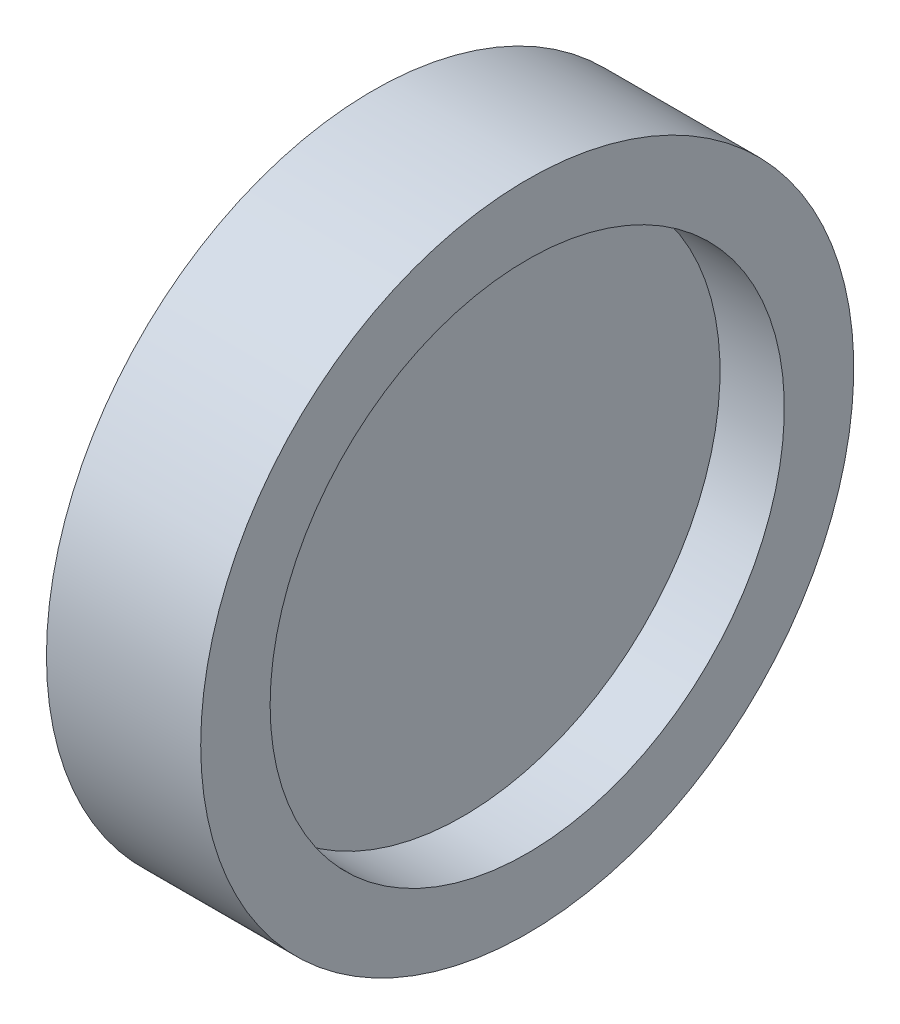
ISO-10303-21;
HEADER;
FILE_DESCRIPTION(('STEP AP214'),'2;1');
FILE_NAME('part.step','',(''),(''),'','','');
FILE_SCHEMA(('AUTOMOTIVE_DESIGN { 1 0 10303 214 1 1 1 1 }'));
ENDSEC;
DATA;
#1=APPLICATION_CONTEXT('core data for automotive mechanical design processes');
#2=APPLICATION_PROTOCOL_DEFINITION('international standard','automotive_design',2000,#1);
#3=PRODUCT_CONTEXT('',#1,'mechanical');
#4=PRODUCT('Part','Part','',(#3));
#5=PRODUCT_RELATED_PRODUCT_CATEGORY('part','',(#4));
#6=PRODUCT_DEFINITION_FORMATION('','',#4);
#7=PRODUCT_DEFINITION_CONTEXT('part definition',#1,'design');
#8=PRODUCT_DEFINITION('design','',#6,#7);
#9=PRODUCT_DEFINITION_SHAPE('','',#8);
#10=(LENGTH_UNIT() NAMED_UNIT(*) SI_UNIT(.MILLI.,.METRE.));
#11=(NAMED_UNIT(*) PLANE_ANGLE_UNIT() SI_UNIT($,.RADIAN.));
#12=(NAMED_UNIT(*) SI_UNIT($,.STERADIAN.) SOLID_ANGLE_UNIT());
#13=UNCERTAINTY_MEASURE_WITH_UNIT(LENGTH_MEASURE(1.E-05),#10,'distance_accuracy_value','');
#14=(GEOMETRIC_REPRESENTATION_CONTEXT(3) GLOBAL_UNCERTAINTY_ASSIGNED_CONTEXT((#13)) GLOBAL_UNIT_ASSIGNED_CONTEXT((#10,
#11,#12)) REPRESENTATION_CONTEXT('',''));
#15=CARTESIAN_POINT('',(0.,0.,0.));
#16=DIRECTION('',(0.,0.,1.));
#17=DIRECTION('',(1.,0.,0.));
#18=AXIS2_PLACEMENT_3D('',#15,#16,#17);
#19=CARTESIAN_POINT('',(0.500000000000001,10.,0.));
#20=DIRECTION('',(-1.,0.,0.));
#21=DIRECTION('',(0.,0.,1.));
#22=AXIS2_PLACEMENT_3D('',#19,#20,#21);
#23=PLANE('',#22);
#24=CARTESIAN_POINT('',(0.500000000000001,0.,0.));
#25=DIRECTION('',(-1.,0.,0.));
#26=DIRECTION('',(0.,0.,1.));
#27=AXIS2_PLACEMENT_3D('',#24,#25,#26);
#28=CIRCLE('',#27,10.);
#29=CARTESIAN_POINT('',(0.500000000000001,0.,10.));
#30=VERTEX_POINT('',#29);
#31=EDGE_CURVE('E10',#30,#30,#28,.T.);
#32=ORIENTED_EDGE('',*,*,#31,.F.);
#33=EDGE_LOOP('',(#32));
#34=FACE_BOUND('',#33,.T.);
#35=ADVANCED_FACE('F37',(#34),#23,.F.);
#36=CARTESIAN_POINT('',(-1.61421241885762,0.,0.));
#37=DIRECTION('',(-1.,0.,0.));
#38=DIRECTION('',(0.,0.,1.));
#39=AXIS2_PLACEMENT_3D('',#36,#37,#38);
#40=CYLINDRICAL_SURFACE('',#39,10.);
#41=CARTESIAN_POINT('',(3.,0.,0.));
#42=DIRECTION('',(-1.,0.,0.));
#43=DIRECTION('',(0.,0.,1.));
#44=AXIS2_PLACEMENT_3D('',#41,#42,#43);
#45=CIRCLE('',#44,10.);
#46=CARTESIAN_POINT('',(3.,0.,10.));
#47=VERTEX_POINT('',#46);
#48=EDGE_CURVE('E60',#47,#47,#45,.T.);
#49=ORIENTED_EDGE('',*,*,#48,.F.);
#50=EDGE_LOOP('',(#49));
#51=FACE_BOUND('',#50,.T.);
#52=ORIENTED_EDGE('',*,*,#31,.T.);
#53=EDGE_LOOP('',(#52));
#54=FACE_BOUND('',#53,.T.);
#55=ADVANCED_FACE('F90',(#51,#54),#40,.F.);
#56=CARTESIAN_POINT('',(-3.,0.,0.));
#57=DIRECTION('',(-1.,0.,0.));
#58=DIRECTION('',(0.,0.,1.));
#59=AXIS2_PLACEMENT_3D('',#56,#57,#58);
#60=CIRCLE('',#59,10.);
#61=CARTESIAN_POINT('',(-3.,0.,10.));
#62=VERTEX_POINT('',#61);
#63=EDGE_CURVE('E64',#62,#62,#60,.T.);
#64=ORIENTED_EDGE('',*,*,#63,.T.);
#65=EDGE_LOOP('',(#64));
#66=FACE_BOUND('',#65,.T.);
#67=CARTESIAN_POINT('',(-0.500000000000001,0.,0.));
#68=DIRECTION('',(1.,0.,0.));
#69=DIRECTION('',(0.,0.,-1.));
#70=AXIS2_PLACEMENT_3D('',#67,#68,#69);
#71=CIRCLE('',#70,10.);
#72=CARTESIAN_POINT('',(-0.500000000000001,0.,-10.));
#73=VERTEX_POINT('',#72);
#74=EDGE_CURVE('E44',#73,#73,#71,.T.);
#75=ORIENTED_EDGE('',*,*,#74,.T.);
#76=EDGE_LOOP('',(#75));
#77=FACE_BOUND('',#76,.T.);
#78=ADVANCED_FACE('F69',(#66,#77),#40,.F.);
#79=CARTESIAN_POINT('',(-3.,10.,0.));
#80=DIRECTION('',(1.,0.,0.));
#81=DIRECTION('',(0.,0.,-1.));
#82=AXIS2_PLACEMENT_3D('',#79,#80,#81);
#83=PLANE('',#82);
#84=ORIENTED_EDGE('',*,*,#63,.F.);
#85=EDGE_LOOP('',(#84));
#86=FACE_BOUND('',#85,.T.);
#87=CARTESIAN_POINT('',(-3.,0.,0.));
#88=DIRECTION('',(-1.,0.,0.));
#89=DIRECTION('',(0.,0.,1.));
#90=AXIS2_PLACEMENT_3D('',#87,#88,#89);
#91=CIRCLE('',#90,12.7);
#92=CARTESIAN_POINT('',(-3.,0.,12.7));
#93=VERTEX_POINT('',#92);
#94=EDGE_CURVE('E49',#93,#93,#91,.T.);
#95=ORIENTED_EDGE('',*,*,#94,.T.);
#96=EDGE_LOOP('',(#95));
#97=FACE_BOUND('',#96,.T.);
#98=ADVANCED_FACE('F71',(#86,#97),#83,.F.);
#99=CARTESIAN_POINT('',(-1.61421241885762,0.,0.));
#100=DIRECTION('',(-1.,0.,0.));
#101=DIRECTION('',(0.,0.,1.));
#102=AXIS2_PLACEMENT_3D('',#99,#100,#101);
#103=CYLINDRICAL_SURFACE('',#102,12.7);
#104=ORIENTED_EDGE('',*,*,#94,.F.);
#105=EDGE_LOOP('',(#104));
#106=FACE_BOUND('',#105,.T.);
#107=CARTESIAN_POINT('',(3.,0.,0.));
#108=DIRECTION('',(-1.,0.,0.));
#109=DIRECTION('',(0.,0.,1.));
#110=AXIS2_PLACEMENT_3D('',#107,#108,#109);
#111=CIRCLE('',#110,12.7);
#112=CARTESIAN_POINT('',(3.,0.,12.7));
#113=VERTEX_POINT('',#112);
#114=EDGE_CURVE('E54',#113,#113,#111,.T.);
#115=ORIENTED_EDGE('',*,*,#114,.T.);
#116=EDGE_LOOP('',(#115));
#117=FACE_BOUND('',#116,.T.);
#118=ADVANCED_FACE('F74',(#106,#117),#103,.T.);
#119=CARTESIAN_POINT('',(3.,12.7,0.));
#120=DIRECTION('',(-1.,0.,0.));
#121=DIRECTION('',(0.,0.,1.));
#122=AXIS2_PLACEMENT_3D('',#119,#120,#121);
#123=PLANE('',#122);
#124=ORIENTED_EDGE('',*,*,#114,.F.);
#125=EDGE_LOOP('',(#124));
#126=FACE_BOUND('',#125,.T.);
#127=ORIENTED_EDGE('',*,*,#48,.T.);
#128=EDGE_LOOP('',(#127));
#129=FACE_BOUND('',#128,.T.);
#130=ADVANCED_FACE('F80',(#126,#129),#123,.F.);
#131=CARTESIAN_POINT('',(-0.500000000000001,10.,0.));
#132=DIRECTION('',(1.,0.,0.));
#133=DIRECTION('',(0.,0.,-1.));
#134=AXIS2_PLACEMENT_3D('',#131,#132,#133);
#135=PLANE('',#134);
#136=ORIENTED_EDGE('',*,*,#74,.F.);
#137=EDGE_LOOP('',(#136));
#138=FACE_BOUND('',#137,.T.);
#139=ADVANCED_FACE('F86',(#138),#135,.F.);
#140=CLOSED_SHELL('',(#35,#55,#78,#98,#118,#130,#139));
#141=MANIFOLD_SOLID_BREP('B2',#140);
#142=ADVANCED_BREP_SHAPE_REPRESENTATION('',(#18,#141),#14);
#143=SHAPE_DEFINITION_REPRESENTATION(#9,#142);
ENDSEC;
END-ISO-10303-21;
